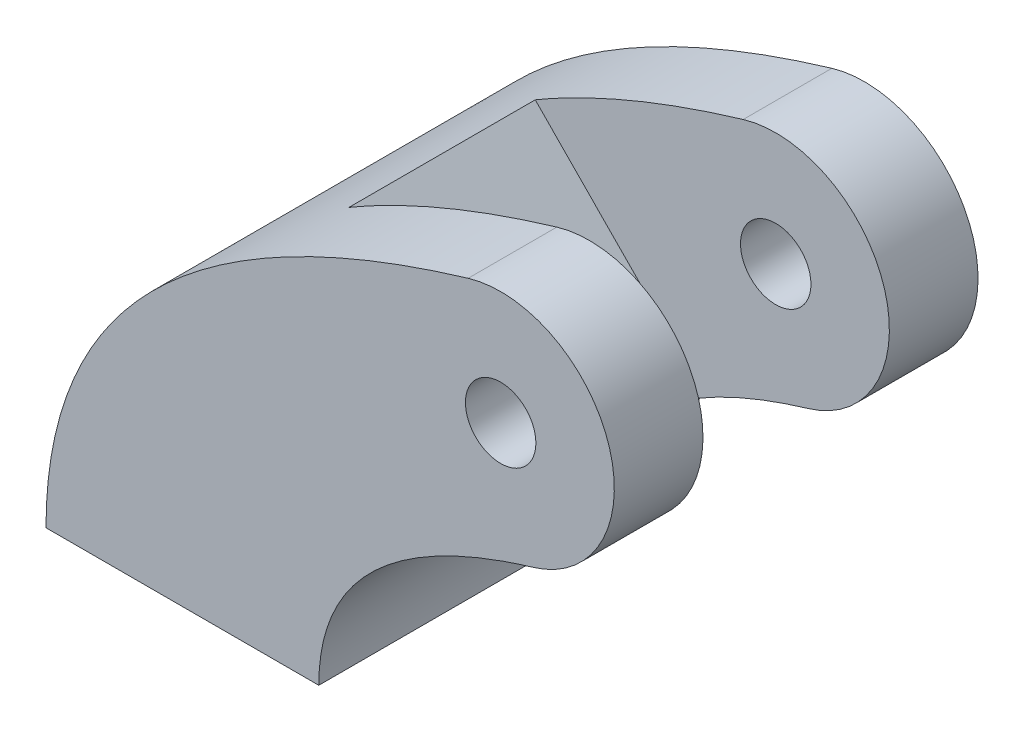
ISO-10303-21;
HEADER;
FILE_DESCRIPTION(('STEP AP214'),'2;1');
FILE_NAME('part.step','',(''),(''),'','','');
FILE_SCHEMA(('AUTOMOTIVE_DESIGN { 1 0 10303 214 1 1 1 1 }'));
ENDSEC;
DATA;
#1=APPLICATION_CONTEXT('core data for automotive mechanical design processes');
#2=APPLICATION_PROTOCOL_DEFINITION('international standard','automotive_design',2000,#1);
#3=PRODUCT_CONTEXT('',#1,'mechanical');
#4=PRODUCT('Part','Part','',(#3));
#5=PRODUCT_RELATED_PRODUCT_CATEGORY('part','',(#4));
#6=PRODUCT_DEFINITION_FORMATION('','',#4);
#7=PRODUCT_DEFINITION_CONTEXT('part definition',#1,'design');
#8=PRODUCT_DEFINITION('design','',#6,#7);
#9=PRODUCT_DEFINITION_SHAPE('','',#8);
#10=(LENGTH_UNIT() NAMED_UNIT(*) SI_UNIT(.MILLI.,.METRE.));
#11=(NAMED_UNIT(*) PLANE_ANGLE_UNIT() SI_UNIT($,.RADIAN.));
#12=(NAMED_UNIT(*) SI_UNIT($,.STERADIAN.) SOLID_ANGLE_UNIT());
#13=UNCERTAINTY_MEASURE_WITH_UNIT(LENGTH_MEASURE(1.E-05),#10,'distance_accuracy_value','');
#14=(GEOMETRIC_REPRESENTATION_CONTEXT(3) GLOBAL_UNCERTAINTY_ASSIGNED_CONTEXT((#13)) GLOBAL_UNIT_ASSIGNED_CONTEXT((#10,
#11,#12)) REPRESENTATION_CONTEXT('',''));
#15=CARTESIAN_POINT('',(0.,0.,0.));
#16=DIRECTION('',(0.,0.,1.));
#17=DIRECTION('',(1.,0.,0.));
#18=AXIS2_PLACEMENT_3D('',#15,#16,#17);
#19=CARTESIAN_POINT('',(-8.,-14.,8.));
#20=CARTESIAN_POINT('',(-8.,-7.60390410749409,8.));
#21=CARTESIAN_POINT('',(1.42916549353131,-4.79139708144706,8.));
#22=B_SPLINE_CURVE_WITH_KNOTS('',2,(#19,#20,#21),.UNSPECIFIED.,.F.,.F.,(3,3),(0.,1.),.UNSPECIFIED.);
#23=DIRECTION('',(0.,0.,-1.));
#24=VECTOR('',#23,1.);
#25=SURFACE_OF_LINEAR_EXTRUSION('',#22,#24);
#26=CARTESIAN_POINT('',(933421.847298187,-358792.275934405,-4.1));
#27=CARTESIAN_POINT('',(-934774.445179607,355250.291347116,-4.1));
#28=CARTESIAN_POINT('',(936096.956963719,-351753.507624309,-4.1));
#29=B_SPLINE_CURVE_WITH_KNOTS('',2,(#26,#27,#28),.UNSPECIFIED.,.F.,.F.,(3,3),(0.,1.),.UNSPECIFIED.);
#30=CARTESIAN_POINT('',(-4.09762899669963,-7.25362628142423,-4.1));
#31=VERTEX_POINT('',#30);
#32=CARTESIAN_POINT('',(1.42916549353131,-4.79139708144706,-4.1));
#33=VERTEX_POINT('',#32);
#34=EDGE_CURVE('E116',#31,#33,#29,.T.);
#35=ORIENTED_EDGE('',*,*,#34,.F.);
#36=DIRECTION('',(0.,0.,1.));
#37=VECTOR('',#36,1.);
#38=CARTESIAN_POINT('',(-4.09762899669963,-7.25362628142423,-4.1));
#39=LINE('',#38,#37);
#40=CARTESIAN_POINT('',(-4.09762899669963,-7.25362628142423,4.1));
#41=VERTEX_POINT('',#40);
#42=EDGE_CURVE('E158',#31,#41,#39,.T.);
#43=ORIENTED_EDGE('',*,*,#42,.T.);
#44=CARTESIAN_POINT('',(933421.847298187,-358792.275934405,4.1));
#45=CARTESIAN_POINT('',(-934774.445179607,355250.291347116,4.1));
#46=CARTESIAN_POINT('',(936096.956963719,-351753.507624309,4.1));
#47=B_SPLINE_CURVE_WITH_KNOTS('',2,(#44,#45,#46),.UNSPECIFIED.,.F.,.F.,(3,3),(0.,1.),.UNSPECIFIED.);
#48=CARTESIAN_POINT('',(1.42916549353131,-4.79139708144706,4.1));
#49=VERTEX_POINT('',#48);
#50=EDGE_CURVE('E278',#41,#49,#47,.T.);
#51=ORIENTED_EDGE('',*,*,#50,.T.);
#52=DIRECTION('',(0.,0.,-1.));
#53=VECTOR('',#52,1.);
#54=CARTESIAN_POINT('',(1.42916549353131,-4.79139708144706,8.));
#55=LINE('',#54,#53);
#56=CARTESIAN_POINT('',(1.42916549353131,-4.79139708144706,8.));
#57=VERTEX_POINT('',#56);
#58=EDGE_CURVE('E143',#57,#49,#55,.T.);
#59=ORIENTED_EDGE('',*,*,#58,.F.);
#60=CARTESIAN_POINT('',(-8.,-14.,8.));
#61=VERTEX_POINT('',#60);
#62=EDGE_CURVE('E211',#61,#57,#22,.T.);
#63=ORIENTED_EDGE('',*,*,#62,.F.);
#64=DIRECTION('',(0.,0.,-1.));
#65=VECTOR('',#64,1.);
#66=CARTESIAN_POINT('',(-8.,-14.,8.));
#67=LINE('',#66,#65);
#68=CARTESIAN_POINT('',(-8.,-14.,-8.));
#69=VERTEX_POINT('',#68);
#70=EDGE_CURVE('E220',#61,#69,#67,.T.);
#71=ORIENTED_EDGE('',*,*,#70,.T.);
#72=CARTESIAN_POINT('',(-8.,-14.,-8.));
#73=CARTESIAN_POINT('',(-8.,-7.60390410749409,-8.));
#74=CARTESIAN_POINT('',(1.42916549353131,-4.79139708144706,-8.));
#75=B_SPLINE_CURVE_WITH_KNOTS('',2,(#72,#73,#74),.UNSPECIFIED.,.F.,.F.,(3,3),(0.,1.),.UNSPECIFIED.);
#76=CARTESIAN_POINT('',(1.42916549353131,-4.79139708144706,-8.));
#77=VERTEX_POINT('',#76);
#78=EDGE_CURVE('E141',#69,#77,#75,.T.);
#79=ORIENTED_EDGE('',*,*,#78,.T.);
#80=EDGE_CURVE('E133',#33,#77,#55,.T.);
#81=ORIENTED_EDGE('',*,*,#80,.F.);
#82=EDGE_LOOP('',(#35,#43,#51,#59,#63,#71,#79,#81));
#83=FACE_BOUND('',#82,.T.);
#84=ADVANCED_FACE('F46',(#83),#25,.F.);
#85=CARTESIAN_POINT('',(0.,0.,8.));
#86=DIRECTION('',(0.,0.,-1.));
#87=DIRECTION('',(-1.,0.,0.));
#88=AXIS2_PLACEMENT_3D('',#85,#86,#87);
#89=CYLINDRICAL_SURFACE('',#88,5.);
#90=CARTESIAN_POINT('',(0.,0.,-4.1));
#91=DIRECTION('',(0.,0.,1.));
#92=DIRECTION('',(1.,0.,0.));
#93=AXIS2_PLACEMENT_3D('',#90,#91,#92);
#94=CIRCLE('',#93,5.);
#95=CARTESIAN_POINT('',(-1.42916549353131,4.79139708144706,-4.1));
#96=VERTEX_POINT('',#95);
#97=EDGE_CURVE('E119',#33,#96,#94,.T.);
#98=ORIENTED_EDGE('',*,*,#97,.F.);
#99=ORIENTED_EDGE('',*,*,#80,.T.);
#100=CARTESIAN_POINT('',(0.,0.,-8.));
#101=DIRECTION('',(0.,0.,1.));
#102=DIRECTION('',(1.,0.,0.));
#103=AXIS2_PLACEMENT_3D('',#100,#101,#102);
#104=CIRCLE('',#103,5.);
#105=CARTESIAN_POINT('',(-1.42916549353131,4.79139708144706,-8.));
#106=VERTEX_POINT('',#105);
#107=EDGE_CURVE('E200',#77,#106,#104,.T.);
#108=ORIENTED_EDGE('',*,*,#107,.T.);
#109=DIRECTION('',(0.,0.,-1.));
#110=VECTOR('',#109,1.);
#111=CARTESIAN_POINT('',(-1.42916549353131,4.79139708144706,8.));
#112=LINE('',#111,#110);
#113=EDGE_CURVE('E135',#96,#106,#112,.T.);
#114=ORIENTED_EDGE('',*,*,#113,.F.);
#115=EDGE_LOOP('',(#98,#99,#108,#114));
#116=FACE_BOUND('',#115,.T.);
#117=ADVANCED_FACE('F131',(#116),#89,.T.);
#118=CARTESIAN_POINT('',(-1.42916549353131,4.79139708144706,8.));
#119=CARTESIAN_POINT('',(-20.,-0.747863266123638,8.));
#120=CARTESIAN_POINT('',(-20.,-14.,8.));
#121=B_SPLINE_CURVE_WITH_KNOTS('',2,(#118,#119,#120),.UNSPECIFIED.,.F.,.F.,(3,3),(0.,1.),.UNSPECIFIED.);
#122=DIRECTION('',(0.,0.,-1.));
#123=VECTOR('',#122,1.);
#124=SURFACE_OF_LINEAR_EXTRUSION('',#121,#123);
#125=CARTESIAN_POINT('',(-1.42916549353131,4.79139708144706,4.1));
#126=CARTESIAN_POINT('',(-20.,-0.747863266123638,4.1));
#127=CARTESIAN_POINT('',(-20.,-14.,4.1));
#128=B_SPLINE_CURVE_WITH_KNOTS('',2,(#125,#126,#127),.UNSPECIFIED.,.F.,.F.,(3,3),(0.,1.),.UNSPECIFIED.);
#129=CARTESIAN_POINT('',(-1.42916549353131,4.79139708144706,4.1));
#130=VERTEX_POINT('',#129);
#131=CARTESIAN_POINT('',(-10.5782235441694,0.965390037537297,4.1));
#132=VERTEX_POINT('',#131);
#133=EDGE_CURVE('E63',#130,#132,#128,.T.);
#134=ORIENTED_EDGE('',*,*,#133,.T.);
#135=DIRECTION('',(0.,0.,-1.));
#136=VECTOR('',#135,1.);
#137=CARTESIAN_POINT('',(-10.5782235441694,0.965390037537297,4.1));
#138=LINE('',#137,#136);
#139=CARTESIAN_POINT('',(-10.5782235441694,0.965390037537298,-4.1));
#140=VERTEX_POINT('',#139);
#141=EDGE_CURVE('E181',#132,#140,#138,.T.);
#142=ORIENTED_EDGE('',*,*,#141,.T.);
#143=CARTESIAN_POINT('',(-1.42916549353131,4.79139708144706,-4.1));
#144=CARTESIAN_POINT('',(-20.,-0.747863266123638,-4.1));
#145=CARTESIAN_POINT('',(-20.,-14.,-4.1));
#146=B_SPLINE_CURVE_WITH_KNOTS('',2,(#143,#144,#145),.UNSPECIFIED.,.F.,.F.,(3,3),(0.,1.),.UNSPECIFIED.);
#147=EDGE_CURVE('E70',#96,#140,#146,.T.);
#148=ORIENTED_EDGE('',*,*,#147,.F.);
#149=ORIENTED_EDGE('',*,*,#113,.T.);
#150=CARTESIAN_POINT('',(-1.42916549353131,4.79139708144706,-8.));
#151=CARTESIAN_POINT('',(-20.,-0.747863266123638,-8.));
#152=CARTESIAN_POINT('',(-20.,-14.,-8.));
#153=B_SPLINE_CURVE_WITH_KNOTS('',2,(#150,#151,#152),.UNSPECIFIED.,.F.,.F.,(3,3),(0.,1.),.UNSPECIFIED.);
#154=CARTESIAN_POINT('',(-20.,-14.,-8.));
#155=VERTEX_POINT('',#154);
#156=EDGE_CURVE('E196',#106,#155,#153,.T.);
#157=ORIENTED_EDGE('',*,*,#156,.T.);
#158=DIRECTION('',(0.,0.,-1.));
#159=VECTOR('',#158,1.);
#160=CARTESIAN_POINT('',(-20.,-14.,8.));
#161=LINE('',#160,#159);
#162=CARTESIAN_POINT('',(-20.,-14.,8.));
#163=VERTEX_POINT('',#162);
#164=EDGE_CURVE('E199',#163,#155,#161,.T.);
#165=ORIENTED_EDGE('',*,*,#164,.F.);
#166=CARTESIAN_POINT('',(-1.42916549353131,4.79139708144706,8.));
#167=VERTEX_POINT('',#166);
#168=EDGE_CURVE('E229',#167,#163,#121,.T.);
#169=ORIENTED_EDGE('',*,*,#168,.F.);
#170=EDGE_CURVE('E144',#167,#130,#112,.T.);
#171=ORIENTED_EDGE('',*,*,#170,.T.);
#172=EDGE_LOOP('',(#134,#142,#148,#149,#157,#165,#169,#171));
#173=FACE_BOUND('',#172,.T.);
#174=ADVANCED_FACE('F193',(#173),#124,.F.);
#175=CARTESIAN_POINT('',(0.,0.,8.));
#176=DIRECTION('',(0.,0.,-1.));
#177=DIRECTION('',(-1.,0.,0.));
#178=AXIS2_PLACEMENT_3D('',#175,#176,#177);
#179=CYLINDRICAL_SURFACE('',#178,1.55);
#180=CARTESIAN_POINT('',(0.,0.,-8.));
#181=DIRECTION('',(0.,0.,1.));
#182=DIRECTION('',(1.,0.,0.));
#183=AXIS2_PLACEMENT_3D('',#180,#181,#182);
#184=CIRCLE('',#183,1.55);
#185=CARTESIAN_POINT('',(1.55,0.,-8.));
#186=VERTEX_POINT('',#185);
#187=EDGE_CURVE('E162',#186,#186,#184,.T.);
#188=ORIENTED_EDGE('',*,*,#187,.F.);
#189=EDGE_LOOP('',(#188));
#190=FACE_BOUND('',#189,.T.);
#191=CARTESIAN_POINT('',(0.,0.,-4.1));
#192=DIRECTION('',(0.,0.,1.));
#193=DIRECTION('',(1.,0.,0.));
#194=AXIS2_PLACEMENT_3D('',#191,#192,#193);
#195=CIRCLE('',#194,1.55);
#196=CARTESIAN_POINT('',(1.55,0.,-4.1));
#197=VERTEX_POINT('',#196);
#198=EDGE_CURVE('E157',#197,#197,#195,.T.);
#199=ORIENTED_EDGE('',*,*,#198,.T.);
#200=EDGE_LOOP('',(#199));
#201=FACE_BOUND('',#200,.T.);
#202=ADVANCED_FACE('F250',(#190,#201),#179,.F.);
#203=CARTESIAN_POINT('',(-5.64270862661717,-8.49980132410881,8.));
#204=DIRECTION('',(0.,0.,-1.));
#205=DIRECTION('',(-1.,0.,0.));
#206=AXIS2_PLACEMENT_3D('',#203,#204,#205);
#207=PLANE('',#206);
#208=ORIENTED_EDGE('',*,*,#62,.T.);
#209=CARTESIAN_POINT('',(0.,0.,8.));
#210=DIRECTION('',(0.,0.,1.));
#211=DIRECTION('',(1.,0.,0.));
#212=AXIS2_PLACEMENT_3D('',#209,#210,#211);
#213=CIRCLE('',#212,5.);
#214=EDGE_CURVE('E233',#57,#167,#213,.T.);
#215=ORIENTED_EDGE('',*,*,#214,.T.);
#216=ORIENTED_EDGE('',*,*,#168,.T.);
#217=DIRECTION('',(1.,0.,0.));
#218=VECTOR('',#217,1.);
#219=CARTESIAN_POINT('',(-20.,-14.,8.));
#220=LINE('',#219,#218);
#221=EDGE_CURVE('E222',#163,#61,#220,.T.);
#222=ORIENTED_EDGE('',*,*,#221,.T.);
#223=EDGE_LOOP('',(#208,#215,#216,#222));
#224=FACE_BOUND('',#223,.T.);
#225=CARTESIAN_POINT('',(0.,0.,8.));
#226=DIRECTION('',(0.,0.,1.));
#227=DIRECTION('',(1.,0.,0.));
#228=AXIS2_PLACEMENT_3D('',#225,#226,#227);
#229=CIRCLE('',#228,1.55);
#230=CARTESIAN_POINT('',(1.55,0.,8.));
#231=VERTEX_POINT('',#230);
#232=EDGE_CURVE('E268',#231,#231,#229,.T.);
#233=ORIENTED_EDGE('',*,*,#232,.F.);
#234=EDGE_LOOP('',(#233));
#235=FACE_BOUND('',#234,.T.);
#236=ADVANCED_FACE('F301',(#224,#235),#207,.F.);
#237=CARTESIAN_POINT('',(-5.64270862661717,-8.49980132410881,-8.));
#238=DIRECTION('',(0.,0.,-1.));
#239=DIRECTION('',(-1.,0.,0.));
#240=AXIS2_PLACEMENT_3D('',#237,#238,#239);
#241=PLANE('',#240);
#242=ORIENTED_EDGE('',*,*,#78,.F.);
#243=DIRECTION('',(1.,0.,0.));
#244=VECTOR('',#243,1.);
#245=CARTESIAN_POINT('',(-20.,-14.,-8.));
#246=LINE('',#245,#244);
#247=EDGE_CURVE('E207',#155,#69,#246,.T.);
#248=ORIENTED_EDGE('',*,*,#247,.F.);
#249=ORIENTED_EDGE('',*,*,#156,.F.);
#250=ORIENTED_EDGE('',*,*,#107,.F.);
#251=EDGE_LOOP('',(#242,#248,#249,#250));
#252=FACE_BOUND('',#251,.T.);
#253=ORIENTED_EDGE('',*,*,#187,.T.);
#254=EDGE_LOOP('',(#253));
#255=FACE_BOUND('',#254,.T.);
#256=ADVANCED_FACE('F205',(#252,#255),#241,.T.);
#257=ORIENTED_EDGE('',*,*,#58,.T.);
#258=CARTESIAN_POINT('',(0.,0.,4.1));
#259=DIRECTION('',(0.,0.,1.));
#260=DIRECTION('',(1.,0.,0.));
#261=AXIS2_PLACEMENT_3D('',#258,#259,#260);
#262=CIRCLE('',#261,5.);
#263=EDGE_CURVE('E167',#49,#130,#262,.T.);
#264=ORIENTED_EDGE('',*,*,#263,.T.);
#265=ORIENTED_EDGE('',*,*,#170,.F.);
#266=ORIENTED_EDGE('',*,*,#214,.F.);
#267=EDGE_LOOP('',(#257,#264,#265,#266));
#268=FACE_BOUND('',#267,.T.);
#269=ADVANCED_FACE('F252',(#268),#89,.T.);
#270=CARTESIAN_POINT('',(-20.,-14.,8.));
#271=DIRECTION('',(0.,1.,0.));
#272=DIRECTION('',(-1.,0.,0.));
#273=AXIS2_PLACEMENT_3D('',#270,#271,#272);
#274=PLANE('',#273);
#275=ORIENTED_EDGE('',*,*,#247,.T.);
#276=ORIENTED_EDGE('',*,*,#70,.F.);
#277=ORIENTED_EDGE('',*,*,#221,.F.);
#278=ORIENTED_EDGE('',*,*,#164,.T.);
#279=EDGE_LOOP('',(#275,#276,#277,#278));
#280=FACE_BOUND('',#279,.T.);
#281=ADVANCED_FACE('F226',(#280),#274,.F.);
#282=CARTESIAN_POINT('',(0.,0.,4.1));
#283=DIRECTION('',(0.,0.,1.));
#284=DIRECTION('',(1.,0.,0.));
#285=AXIS2_PLACEMENT_3D('',#282,#283,#284);
#286=CIRCLE('',#285,1.55);
#287=CARTESIAN_POINT('',(1.55,0.,4.1));
#288=VERTEX_POINT('',#287);
#289=EDGE_CURVE('E153',#288,#288,#286,.T.);
#290=ORIENTED_EDGE('',*,*,#289,.F.);
#291=EDGE_LOOP('',(#290));
#292=FACE_BOUND('',#291,.T.);
#293=ORIENTED_EDGE('',*,*,#232,.T.);
#294=EDGE_LOOP('',(#293));
#295=FACE_BOUND('',#294,.T.);
#296=ADVANCED_FACE('F307',(#292,#295),#179,.F.);
#297=CARTESIAN_POINT('',(-4.09762899669963,-7.25362628142423,-4.1));
#298=DIRECTION('',(-0.958279416289542,-0.285833098705825,0.));
#299=DIRECTION('',(0.285833098705825,-0.958279416289542,0.));
#300=AXIS2_PLACEMENT_3D('',#297,#298,#299);
#301=PLANE('',#300);
#302=DIRECTION('',(0.285833098705825,-0.958279416289542,0.));
#303=VECTOR('',#302,1.);
#304=CARTESIAN_POINT('',(-4.09762899669963,-7.25362628142423,-4.1));
#305=LINE('',#304,#303);
#306=CARTESIAN_POINT('',(-4.79230711174133,-4.92465968656391,-4.1));
#307=VERTEX_POINT('',#306);
#308=EDGE_CURVE('E121',#307,#31,#305,.T.);
#309=ORIENTED_EDGE('',*,*,#308,.F.);
#310=DIRECTION('',(0.,0.,1.));
#311=VECTOR('',#310,1.);
#312=CARTESIAN_POINT('',(-4.79230711174133,-4.92465968656391,-4.1));
#313=LINE('',#312,#311);
#314=CARTESIAN_POINT('',(-4.79230711174133,-4.92465968656391,4.1));
#315=VERTEX_POINT('',#314);
#316=EDGE_CURVE('E149',#307,#315,#313,.T.);
#317=ORIENTED_EDGE('',*,*,#316,.T.);
#318=DIRECTION('',(0.285833098705825,-0.958279416289542,0.));
#319=VECTOR('',#318,1.);
#320=CARTESIAN_POINT('',(-4.09762899669963,-7.25362628142423,4.1));
#321=LINE('',#320,#319);
#322=EDGE_CURVE('E127',#315,#41,#321,.T.);
#323=ORIENTED_EDGE('',*,*,#322,.T.);
#324=ORIENTED_EDGE('',*,*,#42,.F.);
#325=EDGE_LOOP('',(#309,#317,#323,#324));
#326=FACE_BOUND('',#325,.T.);
#327=ADVANCED_FACE('F309',(#326),#301,.F.);
#328=CARTESIAN_POINT('',(-7.52152432727371,-11.3002161205316,-4.1));
#329=DIRECTION('',(0.,0.,1.));
#330=DIRECTION('',(1.,0.,0.));
#331=AXIS2_PLACEMENT_3D('',#328,#329,#330);
#332=PLANE('',#331);
#333=ORIENTED_EDGE('',*,*,#198,.F.);
#334=EDGE_LOOP('',(#333));
#335=FACE_BOUND('',#334,.T.);
#336=ORIENTED_EDGE('',*,*,#34,.T.);
#337=ORIENTED_EDGE('',*,*,#97,.T.);
#338=ORIENTED_EDGE('',*,*,#147,.T.);
#339=DIRECTION('',(0.700772507763378,-0.713384813661622,0.));
#340=VECTOR('',#339,1.);
#341=CARTESIAN_POINT('',(-4.79230711174133,-4.92465968656391,-4.1));
#342=LINE('',#341,#340);
#343=EDGE_CURVE('E11',#140,#307,#342,.T.);
#344=ORIENTED_EDGE('',*,*,#343,.T.);
#345=ORIENTED_EDGE('',*,*,#308,.T.);
#346=EDGE_LOOP('',(#336,#337,#338,#344,#345));
#347=FACE_BOUND('',#346,.T.);
#348=ADVANCED_FACE('F118',(#335,#347),#332,.T.);
#349=CARTESIAN_POINT('',(-7.52152432727371,-11.3002161205316,4.1));
#350=DIRECTION('',(0.,0.,1.));
#351=DIRECTION('',(1.,0.,0.));
#352=AXIS2_PLACEMENT_3D('',#349,#350,#351);
#353=PLANE('',#352);
#354=ORIENTED_EDGE('',*,*,#289,.T.);
#355=EDGE_LOOP('',(#354));
#356=FACE_BOUND('',#355,.T.);
#357=ORIENTED_EDGE('',*,*,#50,.F.);
#358=ORIENTED_EDGE('',*,*,#322,.F.);
#359=DIRECTION('',(-0.700772507763378,0.713384813661622,0.));
#360=VECTOR('',#359,1.);
#361=CARTESIAN_POINT('',(-2.94530571787028,-6.8049028904602,4.1));
#362=LINE('',#361,#360);
#363=EDGE_CURVE('E56',#315,#132,#362,.T.);
#364=ORIENTED_EDGE('',*,*,#363,.T.);
#365=ORIENTED_EDGE('',*,*,#133,.F.);
#366=ORIENTED_EDGE('',*,*,#263,.F.);
#367=EDGE_LOOP('',(#357,#358,#364,#365,#366));
#368=FACE_BOUND('',#367,.T.);
#369=ADVANCED_FACE('F188',(#356,#368),#353,.F.);
#370=CARTESIAN_POINT('',(-4.79230711174133,-4.92465968656391,0.));
#371=DIRECTION('',(0.713384813661622,0.700772507763377,0.));
#372=DIRECTION('',(0.,0.,-1.));
#373=AXIS2_PLACEMENT_3D('',#370,#371,#372);
#374=PLANE('',#373);
#375=ORIENTED_EDGE('',*,*,#343,.F.);
#376=ORIENTED_EDGE('',*,*,#141,.F.);
#377=ORIENTED_EDGE('',*,*,#363,.F.);
#378=ORIENTED_EDGE('',*,*,#316,.F.);
#379=EDGE_LOOP('',(#375,#376,#377,#378));
#380=FACE_BOUND('',#379,.T.);
#381=ADVANCED_FACE('F49',(#380),#374,.T.);
#382=CLOSED_SHELL('',(#84,#117,#174,#202,#236,#256,#269,#281,#296,#327,#348,#369,#381));
#383=MANIFOLD_SOLID_BREP('B2',#382);
#384=ADVANCED_BREP_SHAPE_REPRESENTATION('',(#18,#383),#14);
#385=SHAPE_DEFINITION_REPRESENTATION(#9,#384);
ENDSEC;
END-ISO-10303-21;
